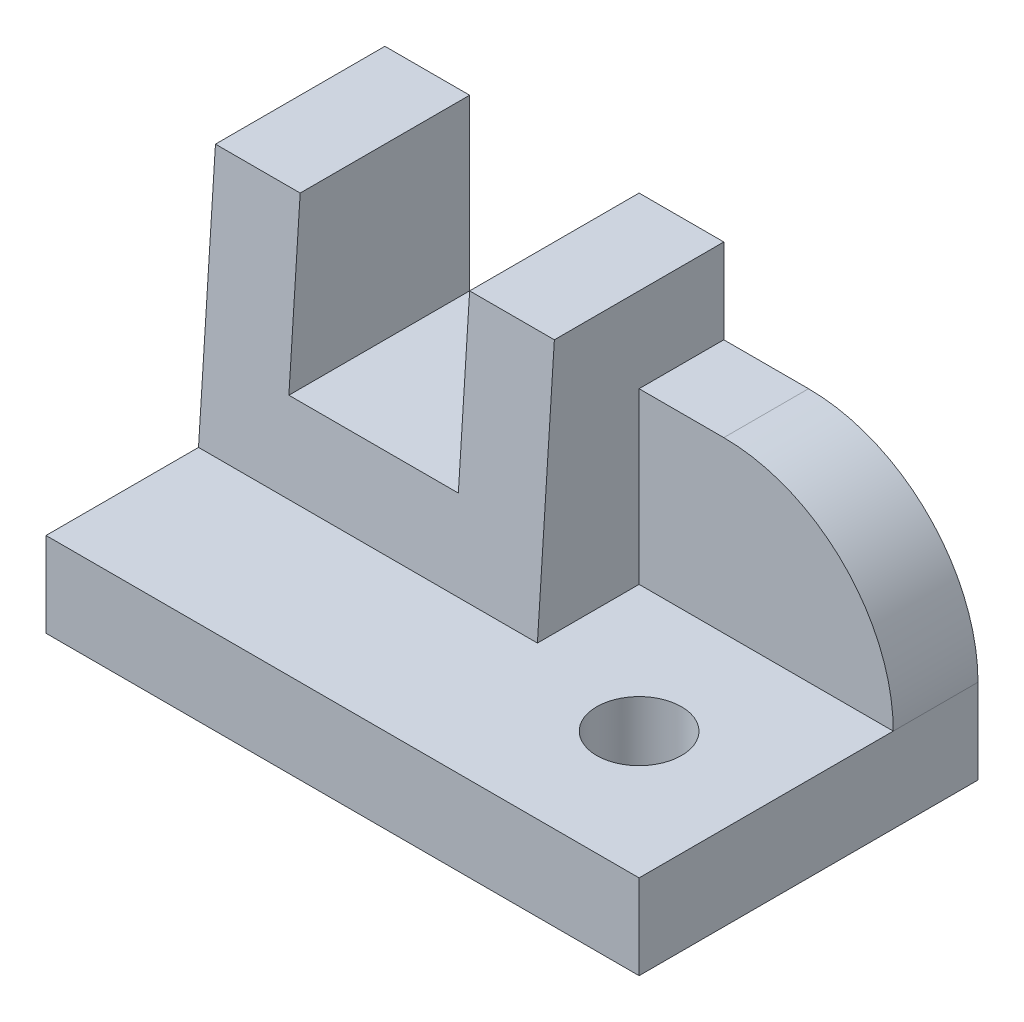
ISO-10303-21;
HEADER;
FILE_DESCRIPTION(('STEP AP214'),'2;1');
FILE_NAME('part.step','',(''),(''),'','','');
FILE_SCHEMA(('AUTOMOTIVE_DESIGN { 1 0 10303 214 1 1 1 1 }'));
ENDSEC;
DATA;
#1=APPLICATION_CONTEXT('core data for automotive mechanical design processes');
#2=APPLICATION_PROTOCOL_DEFINITION('international standard','automotive_design',2000,#1);
#3=PRODUCT_CONTEXT('',#1,'mechanical');
#4=PRODUCT('Part','Part','',(#3));
#5=PRODUCT_RELATED_PRODUCT_CATEGORY('part','',(#4));
#6=PRODUCT_DEFINITION_FORMATION('','',#4);
#7=PRODUCT_DEFINITION_CONTEXT('part definition',#1,'design');
#8=PRODUCT_DEFINITION('design','',#6,#7);
#9=PRODUCT_DEFINITION_SHAPE('','',#8);
#10=(LENGTH_UNIT() NAMED_UNIT(*) SI_UNIT(.MILLI.,.METRE.));
#11=(NAMED_UNIT(*) PLANE_ANGLE_UNIT() SI_UNIT($,.RADIAN.));
#12=(NAMED_UNIT(*) SI_UNIT($,.STERADIAN.) SOLID_ANGLE_UNIT());
#13=UNCERTAINTY_MEASURE_WITH_UNIT(LENGTH_MEASURE(1.E-05),#10,'distance_accuracy_value','');
#14=(GEOMETRIC_REPRESENTATION_CONTEXT(3) GLOBAL_UNCERTAINTY_ASSIGNED_CONTEXT((#13)) GLOBAL_UNIT_ASSIGNED_CONTEXT((#10,
#11,#12)) REPRESENTATION_CONTEXT('',''));
#15=CARTESIAN_POINT('',(0.,0.,0.));
#16=DIRECTION('',(0.,0.,1.));
#17=DIRECTION('',(1.,0.,0.));
#18=AXIS2_PLACEMENT_3D('',#15,#16,#17);
#19=CARTESIAN_POINT('',(40.,40.,-40.));
#20=DIRECTION('',(0.,-1.,0.));
#21=DIRECTION('',(0.,0.,-1.));
#22=AXIS2_PLACEMENT_3D('',#19,#20,#21);
#23=PLANE('',#22);
#24=DIRECTION('',(-1.,0.,0.));
#25=VECTOR('',#24,1.);
#26=CARTESIAN_POINT('',(40.,40.,-20.));
#27=LINE('',#26,#25);
#28=CARTESIAN_POINT('',(9.99999999999998,40.,-20.));
#29=VERTEX_POINT('',#28);
#30=CARTESIAN_POINT('',(0.,40.,-20.));
#31=VERTEX_POINT('',#30);
#32=EDGE_CURVE('E235',#29,#31,#27,.T.);
#33=ORIENTED_EDGE('',*,*,#32,.F.);
#34=DIRECTION('',(0.,0.,-1.));
#35=VECTOR('',#34,1.);
#36=CARTESIAN_POINT('',(9.99999999999998,40.,0.));
#37=LINE('',#36,#35);
#38=CARTESIAN_POINT('',(9.99999999999999,40.,-40.));
#39=VERTEX_POINT('',#38);
#40=EDGE_CURVE('E160',#29,#39,#37,.T.);
#41=ORIENTED_EDGE('',*,*,#40,.T.);
#42=DIRECTION('',(1.,0.,0.));
#43=VECTOR('',#42,1.);
#44=CARTESIAN_POINT('',(40.,40.,-40.));
#45=LINE('',#44,#43);
#46=CARTESIAN_POINT('',(0.,40.,-40.));
#47=VERTEX_POINT('',#46);
#48=EDGE_CURVE('E219',#47,#39,#45,.T.);
#49=ORIENTED_EDGE('',*,*,#48,.F.);
#50=DIRECTION('',(0.,0.,1.));
#51=VECTOR('',#50,1.);
#52=CARTESIAN_POINT('',(0.,40.,-40.));
#53=LINE('',#52,#51);
#54=EDGE_CURVE('E221',#47,#31,#53,.T.);
#55=ORIENTED_EDGE('',*,*,#54,.T.);
#56=EDGE_LOOP('',(#33,#41,#49,#55));
#57=FACE_BOUND('',#56,.T.);
#58=ADVANCED_FACE('F35',(#57),#23,.F.);
#59=CARTESIAN_POINT('',(40.,10.,-18.));
#60=DIRECTION('',(0.,0.0665190105237739,0.997785157856609));
#61=DIRECTION('',(0.,-0.997785157856609,0.0665190105237739));
#62=AXIS2_PLACEMENT_3D('',#59,#60,#61);
#63=PLANE('',#62);
#64=DIRECTION('',(0.,-0.997785157856609,0.0665190105237739));
#65=VECTOR('',#64,1.);
#66=CARTESIAN_POINT('',(9.99999999999998,10.,-18.));
#67=LINE('',#66,#65);
#68=CARTESIAN_POINT('',(9.99999999999998,20.,-18.6666666666667));
#69=VERTEX_POINT('',#68);
#70=EDGE_CURVE('E168',#29,#69,#67,.T.);
#71=ORIENTED_EDGE('',*,*,#70,.F.);
#72=ORIENTED_EDGE('',*,*,#32,.T.);
#73=DIRECTION('',(0.,0.997785157856609,-0.0665190105237739));
#74=VECTOR('',#73,1.);
#75=CARTESIAN_POINT('',(0.,10.,-18.));
#76=LINE('',#75,#74);
#77=CARTESIAN_POINT('',(0.,10.,-18.));
#78=VERTEX_POINT('',#77);
#79=EDGE_CURVE('E224',#78,#31,#76,.T.);
#80=ORIENTED_EDGE('',*,*,#79,.F.);
#81=DIRECTION('',(-1.,0.,0.));
#82=VECTOR('',#81,1.);
#83=CARTESIAN_POINT('',(40.,10.,-18.));
#84=LINE('',#83,#82);
#85=CARTESIAN_POINT('',(40.,10.,-18.));
#86=VERTEX_POINT('',#85);
#87=EDGE_CURVE('E228',#86,#78,#84,.T.);
#88=ORIENTED_EDGE('',*,*,#87,.F.);
#89=DIRECTION('',(0.,0.997785157856609,-0.0665190105237739));
#90=VECTOR('',#89,1.);
#91=CARTESIAN_POINT('',(40.,10.,-18.));
#92=LINE('',#91,#90);
#93=CARTESIAN_POINT('',(40.,40.,-20.));
#94=VERTEX_POINT('',#93);
#95=EDGE_CURVE('E225',#86,#94,#92,.T.);
#96=ORIENTED_EDGE('',*,*,#95,.T.);
#97=CARTESIAN_POINT('',(30.,40.,-20.));
#98=VERTEX_POINT('',#97);
#99=EDGE_CURVE('E231',#94,#98,#27,.T.);
#100=ORIENTED_EDGE('',*,*,#99,.T.);
#101=DIRECTION('',(0.,0.997785157856609,-0.0665190105237739));
#102=VECTOR('',#101,1.);
#103=CARTESIAN_POINT('',(30.,10.,-18.));
#104=LINE('',#103,#102);
#105=CARTESIAN_POINT('',(30.,20.,-18.6666666666667));
#106=VERTEX_POINT('',#105);
#107=EDGE_CURVE('E163',#106,#98,#104,.T.);
#108=ORIENTED_EDGE('',*,*,#107,.F.);
#109=DIRECTION('',(1.,0.,0.));
#110=VECTOR('',#109,1.);
#111=CARTESIAN_POINT('',(40.,20.,-18.6666666666667));
#112=LINE('',#111,#110);
#113=EDGE_CURVE('E140',#69,#106,#112,.T.);
#114=ORIENTED_EDGE('',*,*,#113,.F.);
#115=EDGE_LOOP('',(#71,#72,#80,#88,#96,#100,#108,#114));
#116=FACE_BOUND('',#115,.T.);
#117=ADVANCED_FACE('F270',(#116),#63,.T.);
#118=CARTESIAN_POINT('',(0.,0.,0.));
#119=DIRECTION('',(1.,0.,0.));
#120=DIRECTION('',(0.,0.,-1.));
#121=AXIS2_PLACEMENT_3D('',#118,#119,#120);
#122=PLANE('',#121);
#123=DIRECTION('',(0.,1.,0.));
#124=VECTOR('',#123,1.);
#125=CARTESIAN_POINT('',(0.,40.,-40.));
#126=LINE('',#125,#124);
#127=CARTESIAN_POINT('',(0.,0.,-40.));
#128=VERTEX_POINT('',#127);
#129=EDGE_CURVE('E216',#128,#47,#126,.T.);
#130=ORIENTED_EDGE('',*,*,#129,.F.);
#131=DIRECTION('',(0.,0.,-1.));
#132=VECTOR('',#131,1.);
#133=CARTESIAN_POINT('',(0.,0.,-40.));
#134=LINE('',#133,#132);
#135=CARTESIAN_POINT('',(0.,0.,0.));
#136=VERTEX_POINT('',#135);
#137=EDGE_CURVE('E174',#136,#128,#134,.T.);
#138=ORIENTED_EDGE('',*,*,#137,.F.);
#139=DIRECTION('',(0.,1.,0.));
#140=VECTOR('',#139,1.);
#141=CARTESIAN_POINT('',(0.,0.,0.));
#142=LINE('',#141,#140);
#143=CARTESIAN_POINT('',(0.,10.,0.));
#144=VERTEX_POINT('',#143);
#145=EDGE_CURVE('E192',#136,#144,#142,.T.);
#146=ORIENTED_EDGE('',*,*,#145,.T.);
#147=DIRECTION('',(0.,0.,-1.));
#148=VECTOR('',#147,1.);
#149=CARTESIAN_POINT('',(0.,10.,-40.));
#150=LINE('',#149,#148);
#151=EDGE_CURVE('E186',#144,#78,#150,.T.);
#152=ORIENTED_EDGE('',*,*,#151,.T.);
#153=ORIENTED_EDGE('',*,*,#79,.T.);
#154=ORIENTED_EDGE('',*,*,#54,.F.);
#155=EDGE_LOOP('',(#130,#138,#146,#152,#153,#154));
#156=FACE_BOUND('',#155,.T.);
#157=ADVANCED_FACE('F273',(#156),#122,.F.);
#158=CARTESIAN_POINT('',(30.,40.,-40.));
#159=VERTEX_POINT('',#158);
#160=CARTESIAN_POINT('',(40.,40.,-40.));
#161=VERTEX_POINT('',#160);
#162=EDGE_CURVE('E218',#159,#161,#45,.T.);
#163=ORIENTED_EDGE('',*,*,#162,.F.);
#164=DIRECTION('',(0.,0.,-1.));
#165=VECTOR('',#164,1.);
#166=CARTESIAN_POINT('',(30.,40.,0.));
#167=LINE('',#166,#165);
#168=EDGE_CURVE('E144',#98,#159,#167,.T.);
#169=ORIENTED_EDGE('',*,*,#168,.F.);
#170=ORIENTED_EDGE('',*,*,#99,.F.);
#171=DIRECTION('',(0.,0.,1.));
#172=VECTOR('',#171,1.);
#173=CARTESIAN_POINT('',(40.,40.,-40.));
#174=LINE('',#173,#172);
#175=EDGE_CURVE('E195',#161,#94,#174,.T.);
#176=ORIENTED_EDGE('',*,*,#175,.F.);
#177=EDGE_LOOP('',(#163,#169,#170,#176));
#178=FACE_BOUND('',#177,.T.);
#179=ADVANCED_FACE('F267',(#178),#23,.F.);
#180=CARTESIAN_POINT('',(0.,0.,-40.));
#181=DIRECTION('',(0.,0.,1.));
#182=DIRECTION('',(0.,-1.,0.));
#183=AXIS2_PLACEMENT_3D('',#180,#181,#182);
#184=PLANE('',#183);
#185=DIRECTION('',(1.,0.,0.));
#186=VECTOR('',#185,1.);
#187=CARTESIAN_POINT('',(40.,30.,-40.));
#188=LINE('',#187,#186);
#189=CARTESIAN_POINT('',(40.,30.,-40.));
#190=VERTEX_POINT('',#189);
#191=CARTESIAN_POINT('',(50.,30.,-40.));
#192=VERTEX_POINT('',#191);
#193=EDGE_CURVE('E209',#190,#192,#188,.T.);
#194=ORIENTED_EDGE('',*,*,#193,.T.);
#195=CARTESIAN_POINT('',(50.,9.99999999999999,-40.));
#196=DIRECTION('',(0.,0.,1.));
#197=DIRECTION('',(0.,-1.,0.));
#198=AXIS2_PLACEMENT_3D('',#195,#196,#197);
#199=CIRCLE('',#198,20.);
#200=CARTESIAN_POINT('',(70.,10.,-40.));
#201=VERTEX_POINT('',#200);
#202=EDGE_CURVE('E50',#192,#201,#199,.F.);
#203=ORIENTED_EDGE('',*,*,#202,.T.);
#204=DIRECTION('',(0.,1.,0.));
#205=VECTOR('',#204,1.);
#206=CARTESIAN_POINT('',(70.,40.,-40.));
#207=LINE('',#206,#205);
#208=CARTESIAN_POINT('',(70.,0.,-40.));
#209=VERTEX_POINT('',#208);
#210=EDGE_CURVE('E211',#209,#201,#207,.T.);
#211=ORIENTED_EDGE('',*,*,#210,.F.);
#212=DIRECTION('',(1.,0.,0.));
#213=VECTOR('',#212,1.);
#214=CARTESIAN_POINT('',(70.,0.,-40.));
#215=LINE('',#214,#213);
#216=EDGE_CURVE('E178',#128,#209,#215,.T.);
#217=ORIENTED_EDGE('',*,*,#216,.F.);
#218=ORIENTED_EDGE('',*,*,#129,.T.);
#219=ORIENTED_EDGE('',*,*,#48,.T.);
#220=DIRECTION('',(0.,1.,0.));
#221=VECTOR('',#220,1.);
#222=CARTESIAN_POINT('',(9.99999999999999,20.,-40.));
#223=LINE('',#222,#221);
#224=CARTESIAN_POINT('',(9.99999999999999,20.,-40.));
#225=VERTEX_POINT('',#224);
#226=EDGE_CURVE('E155',#225,#39,#223,.T.);
#227=ORIENTED_EDGE('',*,*,#226,.F.);
#228=DIRECTION('',(-1.,0.,0.));
#229=VECTOR('',#228,1.);
#230=CARTESIAN_POINT('',(30.,20.,-40.));
#231=LINE('',#230,#229);
#232=CARTESIAN_POINT('',(30.,20.,-40.));
#233=VERTEX_POINT('',#232);
#234=EDGE_CURVE('E137',#233,#225,#231,.T.);
#235=ORIENTED_EDGE('',*,*,#234,.F.);
#236=DIRECTION('',(0.,-1.,0.));
#237=VECTOR('',#236,1.);
#238=CARTESIAN_POINT('',(30.,40.,-40.));
#239=LINE('',#238,#237);
#240=EDGE_CURVE('E147',#159,#233,#239,.T.);
#241=ORIENTED_EDGE('',*,*,#240,.F.);
#242=ORIENTED_EDGE('',*,*,#162,.T.);
#243=DIRECTION('',(0.,1.,0.));
#244=VECTOR('',#243,1.);
#245=CARTESIAN_POINT('',(40.,30.,-40.));
#246=LINE('',#245,#244);
#247=EDGE_CURVE('E205',#190,#161,#246,.T.);
#248=ORIENTED_EDGE('',*,*,#247,.F.);
#249=EDGE_LOOP('',(#194,#203,#211,#217,#218,#219,#227,#235,#241,#242,#248));
#250=FACE_BOUND('',#249,.T.);
#251=ADVANCED_FACE('F153',(#250),#184,.F.);
#252=CARTESIAN_POINT('',(70.,0.,0.));
#253=DIRECTION('',(-1.,0.,0.));
#254=DIRECTION('',(0.,0.,1.));
#255=AXIS2_PLACEMENT_3D('',#252,#253,#254);
#256=PLANE('',#255);
#257=ORIENTED_EDGE('',*,*,#210,.T.);
#258=DIRECTION('',(0.,0.,-1.));
#259=VECTOR('',#258,1.);
#260=CARTESIAN_POINT('',(70.,9.99999999999999,0.));
#261=LINE('',#260,#259);
#262=CARTESIAN_POINT('',(70.,10.,-30.));
#263=VERTEX_POINT('',#262);
#264=EDGE_CURVE('E43',#201,#263,#261,.F.);
#265=ORIENTED_EDGE('',*,*,#264,.T.);
#266=DIRECTION('',(0.,0.,1.));
#267=VECTOR('',#266,1.);
#268=CARTESIAN_POINT('',(70.,10.,0.));
#269=LINE('',#268,#267);
#270=CARTESIAN_POINT('',(70.,10.,0.));
#271=VERTEX_POINT('',#270);
#272=EDGE_CURVE('E175',#263,#271,#269,.T.);
#273=ORIENTED_EDGE('',*,*,#272,.T.);
#274=DIRECTION('',(0.,1.,0.));
#275=VECTOR('',#274,1.);
#276=CARTESIAN_POINT('',(70.,0.,0.));
#277=LINE('',#276,#275);
#278=CARTESIAN_POINT('',(70.,0.,0.));
#279=VERTEX_POINT('',#278);
#280=EDGE_CURVE('E183',#279,#271,#277,.T.);
#281=ORIENTED_EDGE('',*,*,#280,.F.);
#282=DIRECTION('',(0.,0.,1.));
#283=VECTOR('',#282,1.);
#284=CARTESIAN_POINT('',(70.,0.,0.));
#285=LINE('',#284,#283);
#286=EDGE_CURVE('E181',#209,#279,#285,.T.);
#287=ORIENTED_EDGE('',*,*,#286,.F.);
#288=EDGE_LOOP('',(#257,#265,#273,#281,#287));
#289=FACE_BOUND('',#288,.T.);
#290=ADVANCED_FACE('F245',(#289),#256,.F.);
#291=CARTESIAN_POINT('',(40.,30.,-30.));
#292=DIRECTION('',(0.,-1.,0.));
#293=DIRECTION('',(0.,0.,-1.));
#294=AXIS2_PLACEMENT_3D('',#291,#292,#293);
#295=PLANE('',#294);
#296=DIRECTION('',(1.,0.,0.));
#297=VECTOR('',#296,1.);
#298=CARTESIAN_POINT('',(40.,30.,-30.));
#299=LINE('',#298,#297);
#300=CARTESIAN_POINT('',(40.,30.,-30.));
#301=VERTEX_POINT('',#300);
#302=CARTESIAN_POINT('',(50.,30.,-30.));
#303=VERTEX_POINT('',#302);
#304=EDGE_CURVE('E212',#301,#303,#299,.T.);
#305=ORIENTED_EDGE('',*,*,#304,.T.);
#306=DIRECTION('',(0.,0.,-1.));
#307=VECTOR('',#306,1.);
#308=CARTESIAN_POINT('',(50.,30.,-30.));
#309=LINE('',#308,#307);
#310=EDGE_CURVE('E234',#303,#192,#309,.T.);
#311=ORIENTED_EDGE('',*,*,#310,.T.);
#312=ORIENTED_EDGE('',*,*,#193,.F.);
#313=DIRECTION('',(0.,0.,-1.));
#314=VECTOR('',#313,1.);
#315=CARTESIAN_POINT('',(40.,30.,-30.));
#316=LINE('',#315,#314);
#317=EDGE_CURVE('E202',#301,#190,#316,.T.);
#318=ORIENTED_EDGE('',*,*,#317,.F.);
#319=EDGE_LOOP('',(#305,#311,#312,#318));
#320=FACE_BOUND('',#319,.T.);
#321=ADVANCED_FACE('F259',(#320),#295,.F.);
#322=CARTESIAN_POINT('',(40.,10.,-30.));
#323=DIRECTION('',(0.,0.,-1.));
#324=DIRECTION('',(-1.,0.,0.));
#325=AXIS2_PLACEMENT_3D('',#322,#323,#324);
#326=PLANE('',#325);
#327=DIRECTION('',(1.,0.,0.));
#328=VECTOR('',#327,1.);
#329=CARTESIAN_POINT('',(40.,10.,-30.));
#330=LINE('',#329,#328);
#331=CARTESIAN_POINT('',(40.,10.,-30.));
#332=VERTEX_POINT('',#331);
#333=EDGE_CURVE('E208',#332,#263,#330,.T.);
#334=ORIENTED_EDGE('',*,*,#333,.T.);
#335=CARTESIAN_POINT('',(50.,9.99999999999999,-30.));
#336=DIRECTION('',(0.,0.,-1.));
#337=DIRECTION('',(-1.,0.,0.));
#338=AXIS2_PLACEMENT_3D('',#335,#336,#337);
#339=CIRCLE('',#338,20.);
#340=EDGE_CURVE('E11',#263,#303,#339,.F.);
#341=ORIENTED_EDGE('',*,*,#340,.T.);
#342=ORIENTED_EDGE('',*,*,#304,.F.);
#343=DIRECTION('',(0.,1.,0.));
#344=VECTOR('',#343,1.);
#345=CARTESIAN_POINT('',(40.,10.,-30.));
#346=LINE('',#345,#344);
#347=EDGE_CURVE('E199',#332,#301,#346,.T.);
#348=ORIENTED_EDGE('',*,*,#347,.F.);
#349=EDGE_LOOP('',(#334,#341,#342,#348));
#350=FACE_BOUND('',#349,.T.);
#351=ADVANCED_FACE('F252',(#350),#326,.F.);
#352=CARTESIAN_POINT('',(40.,0.,0.));
#353=DIRECTION('',(-1.,0.,0.));
#354=DIRECTION('',(0.,0.,1.));
#355=AXIS2_PLACEMENT_3D('',#352,#353,#354);
#356=PLANE('',#355);
#357=ORIENTED_EDGE('',*,*,#95,.F.);
#358=DIRECTION('',(0.,0.,-1.));
#359=VECTOR('',#358,1.);
#360=CARTESIAN_POINT('',(40.,10.,0.));
#361=LINE('',#360,#359);
#362=EDGE_CURVE('E197',#86,#332,#361,.T.);
#363=ORIENTED_EDGE('',*,*,#362,.T.);
#364=ORIENTED_EDGE('',*,*,#347,.T.);
#365=ORIENTED_EDGE('',*,*,#317,.T.);
#366=ORIENTED_EDGE('',*,*,#247,.T.);
#367=ORIENTED_EDGE('',*,*,#175,.T.);
#368=EDGE_LOOP('',(#357,#363,#364,#365,#366,#367));
#369=FACE_BOUND('',#368,.T.);
#370=ADVANCED_FACE('F264',(#369),#356,.F.);
#371=CARTESIAN_POINT('',(0.,10.,0.));
#372=DIRECTION('',(0.,1.,0.));
#373=DIRECTION('',(0.,0.,1.));
#374=AXIS2_PLACEMENT_3D('',#371,#372,#373);
#375=PLANE('',#374);
#376=CARTESIAN_POINT('',(55.,10.,-15.));
#377=DIRECTION('',(0.,1.,0.));
#378=DIRECTION('',(0.,0.,1.));
#379=AXIS2_PLACEMENT_3D('',#376,#377,#378);
#380=CIRCLE('',#379,4.99999999999998);
#381=CARTESIAN_POINT('',(55.,10.,-10.));
#382=VERTEX_POINT('',#381);
#383=EDGE_CURVE('E151',#382,#382,#380,.T.);
#384=ORIENTED_EDGE('',*,*,#383,.F.);
#385=EDGE_LOOP('',(#384));
#386=FACE_BOUND('',#385,.T.);
#387=ORIENTED_EDGE('',*,*,#333,.F.);
#388=ORIENTED_EDGE('',*,*,#362,.F.);
#389=ORIENTED_EDGE('',*,*,#87,.T.);
#390=ORIENTED_EDGE('',*,*,#151,.F.);
#391=DIRECTION('',(-1.,0.,0.));
#392=VECTOR('',#391,1.);
#393=CARTESIAN_POINT('',(0.,10.,0.));
#394=LINE('',#393,#392);
#395=EDGE_CURVE('E170',#271,#144,#394,.T.);
#396=ORIENTED_EDGE('',*,*,#395,.F.);
#397=ORIENTED_EDGE('',*,*,#272,.F.);
#398=EDGE_LOOP('',(#387,#388,#389,#390,#396,#397));
#399=FACE_BOUND('',#398,.T.);
#400=ADVANCED_FACE('F256',(#386,#399),#375,.T.);
#401=CARTESIAN_POINT('',(0.,0.,0.));
#402=DIRECTION('',(0.,0.,-1.));
#403=DIRECTION('',(-1.,0.,0.));
#404=AXIS2_PLACEMENT_3D('',#401,#402,#403);
#405=PLANE('',#404);
#406=ORIENTED_EDGE('',*,*,#395,.T.);
#407=ORIENTED_EDGE('',*,*,#145,.F.);
#408=DIRECTION('',(-1.,0.,0.));
#409=VECTOR('',#408,1.);
#410=CARTESIAN_POINT('',(0.,0.,0.));
#411=LINE('',#410,#409);
#412=EDGE_CURVE('E171',#279,#136,#411,.T.);
#413=ORIENTED_EDGE('',*,*,#412,.F.);
#414=ORIENTED_EDGE('',*,*,#280,.T.);
#415=EDGE_LOOP('',(#406,#407,#413,#414));
#416=FACE_BOUND('',#415,.T.);
#417=ADVANCED_FACE('F278',(#416),#405,.F.);
#418=CARTESIAN_POINT('',(0.,0.,0.));
#419=DIRECTION('',(0.,1.,0.));
#420=DIRECTION('',(0.,0.,1.));
#421=AXIS2_PLACEMENT_3D('',#418,#419,#420);
#422=PLANE('',#421);
#423=CARTESIAN_POINT('',(55.,0.,-15.));
#424=DIRECTION('',(0.,-1.,0.));
#425=DIRECTION('',(0.,0.,-1.));
#426=AXIS2_PLACEMENT_3D('',#423,#424,#425);
#427=CIRCLE('',#426,4.99999999999998);
#428=CARTESIAN_POINT('',(55.,0.,-20.));
#429=VERTEX_POINT('',#428);
#430=EDGE_CURVE('E240',#429,#429,#427,.T.);
#431=ORIENTED_EDGE('',*,*,#430,.F.);
#432=EDGE_LOOP('',(#431));
#433=FACE_BOUND('',#432,.T.);
#434=ORIENTED_EDGE('',*,*,#412,.T.);
#435=ORIENTED_EDGE('',*,*,#137,.T.);
#436=ORIENTED_EDGE('',*,*,#216,.T.);
#437=ORIENTED_EDGE('',*,*,#286,.T.);
#438=EDGE_LOOP('',(#434,#435,#436,#437));
#439=FACE_BOUND('',#438,.T.);
#440=ADVANCED_FACE('F280',(#433,#439),#422,.F.);
#441=CARTESIAN_POINT('',(9.99999999999998,20.,0.));
#442=DIRECTION('',(-1.,0.,0.));
#443=DIRECTION('',(0.,0.,1.));
#444=AXIS2_PLACEMENT_3D('',#441,#442,#443);
#445=PLANE('',#444);
#446=ORIENTED_EDGE('',*,*,#70,.T.);
#447=DIRECTION('',(0.,0.,-1.));
#448=VECTOR('',#447,1.);
#449=CARTESIAN_POINT('',(9.99999999999998,20.,0.));
#450=LINE('',#449,#448);
#451=EDGE_CURVE('E143',#69,#225,#450,.T.);
#452=ORIENTED_EDGE('',*,*,#451,.T.);
#453=ORIENTED_EDGE('',*,*,#226,.T.);
#454=ORIENTED_EDGE('',*,*,#40,.F.);
#455=EDGE_LOOP('',(#446,#452,#453,#454));
#456=FACE_BOUND('',#455,.T.);
#457=ADVANCED_FACE('F286',(#456),#445,.F.);
#458=CARTESIAN_POINT('',(30.,20.,0.));
#459=DIRECTION('',(0.,-1.,0.));
#460=DIRECTION('',(0.,0.,-1.));
#461=AXIS2_PLACEMENT_3D('',#458,#459,#460);
#462=PLANE('',#461);
#463=ORIENTED_EDGE('',*,*,#113,.T.);
#464=DIRECTION('',(0.,0.,-1.));
#465=VECTOR('',#464,1.);
#466=CARTESIAN_POINT('',(30.,20.,0.));
#467=LINE('',#466,#465);
#468=EDGE_CURVE('E132',#106,#233,#467,.T.);
#469=ORIENTED_EDGE('',*,*,#468,.T.);
#470=ORIENTED_EDGE('',*,*,#234,.T.);
#471=ORIENTED_EDGE('',*,*,#451,.F.);
#472=EDGE_LOOP('',(#463,#469,#470,#471));
#473=FACE_BOUND('',#472,.T.);
#474=ADVANCED_FACE('F134',(#473),#462,.F.);
#475=CARTESIAN_POINT('',(30.,40.,0.));
#476=DIRECTION('',(1.,0.,0.));
#477=DIRECTION('',(0.,0.,-1.));
#478=AXIS2_PLACEMENT_3D('',#475,#476,#477);
#479=PLANE('',#478);
#480=ORIENTED_EDGE('',*,*,#107,.T.);
#481=ORIENTED_EDGE('',*,*,#168,.T.);
#482=ORIENTED_EDGE('',*,*,#240,.T.);
#483=ORIENTED_EDGE('',*,*,#468,.F.);
#484=EDGE_LOOP('',(#480,#481,#482,#483));
#485=FACE_BOUND('',#484,.T.);
#486=ADVANCED_FACE('F148',(#485),#479,.F.);
#487=CARTESIAN_POINT('',(55.,0.,-15.));
#488=DIRECTION('',(0.,-1.,0.));
#489=DIRECTION('',(0.,0.,-1.));
#490=AXIS2_PLACEMENT_3D('',#487,#488,#489);
#491=CYLINDRICAL_SURFACE('',#490,4.99999999999998);
#492=ORIENTED_EDGE('',*,*,#383,.T.);
#493=EDGE_LOOP('',(#492));
#494=FACE_BOUND('',#493,.T.);
#495=ORIENTED_EDGE('',*,*,#430,.T.);
#496=EDGE_LOOP('',(#495));
#497=FACE_BOUND('',#496,.T.);
#498=ADVANCED_FACE('F346',(#494,#497),#491,.F.);
#499=CARTESIAN_POINT('',(50.,9.99999999999999,-30.));
#500=DIRECTION('',(0.,0.,-1.));
#501=DIRECTION('',(-1.,0.,0.));
#502=AXIS2_PLACEMENT_3D('',#499,#500,#501);
#503=CYLINDRICAL_SURFACE('',#502,20.);
#504=ORIENTED_EDGE('',*,*,#340,.F.);
#505=ORIENTED_EDGE('',*,*,#264,.F.);
#506=ORIENTED_EDGE('',*,*,#202,.F.);
#507=ORIENTED_EDGE('',*,*,#310,.F.);
#508=EDGE_LOOP('',(#504,#505,#506,#507));
#509=FACE_BOUND('',#508,.T.);
#510=ADVANCED_FACE('F37',(#509),#503,.T.);
#511=CLOSED_SHELL('',(#58,#117,#157,#179,#251,#290,#321,#351,#370,#400,#417,#440,#457,#474,#486,
#498,#510));
#512=MANIFOLD_SOLID_BREP('B2',#511);
#513=ADVANCED_BREP_SHAPE_REPRESENTATION('',(#18,#512),#14);
#514=SHAPE_DEFINITION_REPRESENTATION(#9,#513);
ENDSEC;
END-ISO-10303-21;
